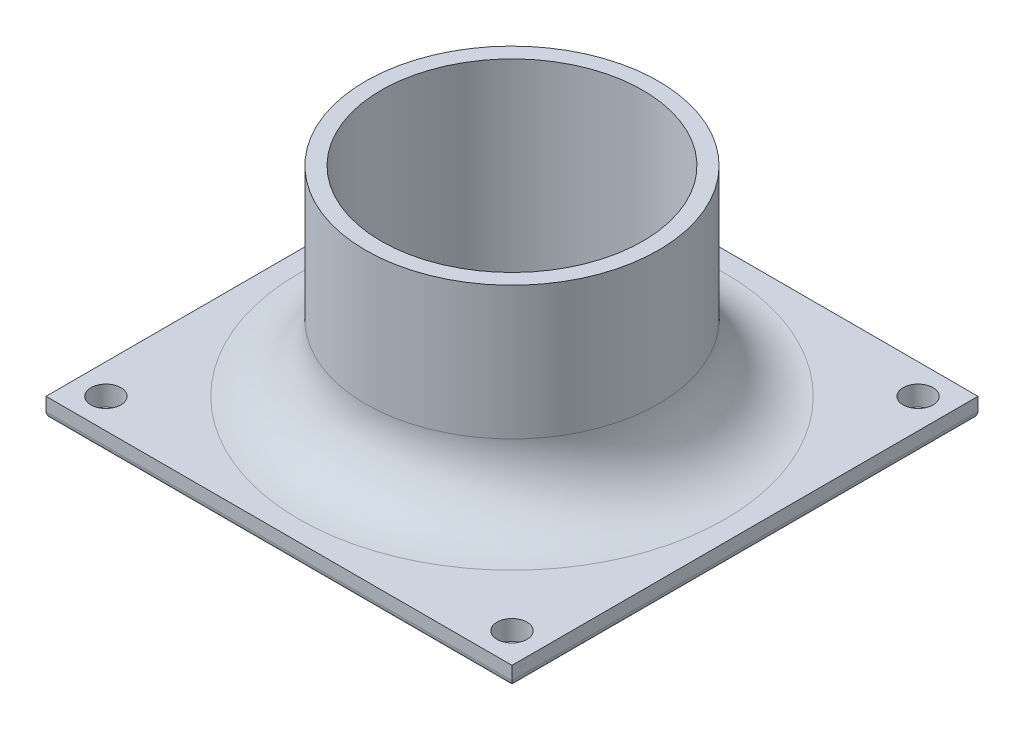
ISO-10303-21;
HEADER;
FILE_DESCRIPTION(('STEP AP214'),'2;1');
FILE_NAME('part.step','',(''),(''),'','','');
FILE_SCHEMA(('AUTOMOTIVE_DESIGN { 1 0 10303 214 1 1 1 1 }'));
ENDSEC;
DATA;
#1=APPLICATION_CONTEXT('core data for automotive mechanical design processes');
#2=APPLICATION_PROTOCOL_DEFINITION('international standard','automotive_design',2000,#1);
#3=PRODUCT_CONTEXT('',#1,'mechanical');
#4=PRODUCT('Part','Part','',(#3));
#5=PRODUCT_RELATED_PRODUCT_CATEGORY('part','',(#4));
#6=PRODUCT_DEFINITION_FORMATION('','',#4);
#7=PRODUCT_DEFINITION_CONTEXT('part definition',#1,'design');
#8=PRODUCT_DEFINITION('design','',#6,#7);
#9=PRODUCT_DEFINITION_SHAPE('','',#8);
#10=(LENGTH_UNIT() NAMED_UNIT(*) SI_UNIT(.MILLI.,.METRE.));
#11=(NAMED_UNIT(*) PLANE_ANGLE_UNIT() SI_UNIT($,.RADIAN.));
#12=(NAMED_UNIT(*) SI_UNIT($,.STERADIAN.) SOLID_ANGLE_UNIT());
#13=UNCERTAINTY_MEASURE_WITH_UNIT(LENGTH_MEASURE(1.E-05),#10,'distance_accuracy_value','');
#14=(GEOMETRIC_REPRESENTATION_CONTEXT(3) GLOBAL_UNCERTAINTY_ASSIGNED_CONTEXT((#13)) GLOBAL_UNIT_ASSIGNED_CONTEXT((#10,
#11,#12)) REPRESENTATION_CONTEXT('',''));
#15=CARTESIAN_POINT('',(0.,0.,0.));
#16=DIRECTION('',(0.,0.,1.));
#17=DIRECTION('',(1.,0.,0.));
#18=AXIS2_PLACEMENT_3D('',#15,#16,#17);
#19=CARTESIAN_POINT('',(0.,3.,0.));
#20=DIRECTION('',(0.,1.,0.));
#21=DIRECTION('',(0.,0.,1.));
#22=AXIS2_PLACEMENT_3D('',#19,#20,#21);
#23=PLANE('',#22);
#24=CARTESIAN_POINT('',(0.,3.,0.));
#25=DIRECTION('',(0.,1.,0.));
#26=DIRECTION('',(0.,0.,1.));
#27=AXIS2_PLACEMENT_3D('',#24,#25,#26);
#28=CIRCLE('',#27,18.);
#29=CARTESIAN_POINT('',(0.,3.,18.));
#30=VERTEX_POINT('',#29);
#31=EDGE_CURVE('E182',#30,#30,#28,.T.);
#32=ORIENTED_EDGE('',*,*,#31,.F.);
#33=EDGE_LOOP('',(#32));
#34=FACE_BOUND('',#33,.T.);
#35=CARTESIAN_POINT('',(0.,3.,0.));
#36=DIRECTION('',(0.,1.,0.));
#37=DIRECTION('',(0.,0.,1.));
#38=AXIS2_PLACEMENT_3D('',#35,#36,#37);
#39=CIRCLE('',#38,19.65);
#40=CARTESIAN_POINT('',(0.,3.,19.65));
#41=VERTEX_POINT('',#40);
#42=EDGE_CURVE('E107',#41,#41,#39,.F.);
#43=ORIENTED_EDGE('',*,*,#42,.F.);
#44=EDGE_LOOP('',(#43));
#45=FACE_BOUND('',#44,.T.);
#46=ADVANCED_FACE('F37',(#34,#45),#23,.T.);
#47=CARTESIAN_POINT('',(35.,3.,-35.));
#48=DIRECTION('',(-1.,0.,0.));
#49=DIRECTION('',(0.,0.,1.));
#50=AXIS2_PLACEMENT_3D('',#47,#48,#49);
#51=PLANE('',#50);
#52=DIRECTION('',(0.,-1.,0.));
#53=VECTOR('',#52,1.);
#54=CARTESIAN_POINT('',(35.,3.,35.));
#55=LINE('',#54,#53);
#56=CARTESIAN_POINT('',(35.,3.,35.));
#57=VERTEX_POINT('',#56);
#58=CARTESIAN_POINT('',(35.,1.,35.));
#59=VERTEX_POINT('',#58);
#60=EDGE_CURVE('E189',#57,#59,#55,.T.);
#61=ORIENTED_EDGE('',*,*,#60,.T.);
#62=DIRECTION('',(0.,0.,-1.));
#63=VECTOR('',#62,1.);
#64=CARTESIAN_POINT('',(35.,1.,-35.));
#65=LINE('',#64,#63);
#66=CARTESIAN_POINT('',(35.,1.,-35.));
#67=VERTEX_POINT('',#66);
#68=EDGE_CURVE('E11',#59,#67,#65,.T.);
#69=ORIENTED_EDGE('',*,*,#68,.T.);
#70=DIRECTION('',(0.,-1.,0.));
#71=VECTOR('',#70,1.);
#72=CARTESIAN_POINT('',(35.,3.,-35.));
#73=LINE('',#72,#71);
#74=CARTESIAN_POINT('',(35.,3.,-35.));
#75=VERTEX_POINT('',#74);
#76=EDGE_CURVE('E92',#75,#67,#73,.T.);
#77=ORIENTED_EDGE('',*,*,#76,.F.);
#78=DIRECTION('',(0.,0.,-1.));
#79=VECTOR('',#78,1.);
#80=CARTESIAN_POINT('',(35.,3.,-35.));
#81=LINE('',#80,#79);
#82=EDGE_CURVE('E97',#57,#75,#81,.T.);
#83=ORIENTED_EDGE('',*,*,#82,.F.);
#84=EDGE_LOOP('',(#61,#69,#77,#83));
#85=FACE_BOUND('',#84,.T.);
#86=ADVANCED_FACE('F106',(#85),#51,.F.);
#87=CARTESIAN_POINT('',(-35.,3.,-35.));
#88=DIRECTION('',(0.,0.,1.));
#89=DIRECTION('',(1.,0.,0.));
#90=AXIS2_PLACEMENT_3D('',#87,#88,#89);
#91=PLANE('',#90);
#92=ORIENTED_EDGE('',*,*,#76,.T.);
#93=DIRECTION('',(-1.,0.,0.));
#94=VECTOR('',#93,1.);
#95=CARTESIAN_POINT('',(-35.,1.,-35.));
#96=LINE('',#95,#94);
#97=CARTESIAN_POINT('',(-35.,1.,-35.));
#98=VERTEX_POINT('',#97);
#99=EDGE_CURVE('E46',#67,#98,#96,.T.);
#100=ORIENTED_EDGE('',*,*,#99,.T.);
#101=DIRECTION('',(0.,-1.,0.));
#102=VECTOR('',#101,1.);
#103=CARTESIAN_POINT('',(-35.,3.,-35.));
#104=LINE('',#103,#102);
#105=CARTESIAN_POINT('',(-35.,3.,-35.));
#106=VERTEX_POINT('',#105);
#107=EDGE_CURVE('E93',#106,#98,#104,.T.);
#108=ORIENTED_EDGE('',*,*,#107,.F.);
#109=DIRECTION('',(-1.,0.,0.));
#110=VECTOR('',#109,1.);
#111=CARTESIAN_POINT('',(-35.,3.,-35.));
#112=LINE('',#111,#110);
#113=EDGE_CURVE('E89',#75,#106,#112,.T.);
#114=ORIENTED_EDGE('',*,*,#113,.F.);
#115=EDGE_LOOP('',(#92,#100,#108,#114));
#116=FACE_BOUND('',#115,.T.);
#117=ADVANCED_FACE('F91',(#116),#91,.F.);
#118=CARTESIAN_POINT('',(-35.,3.,-35.));
#119=DIRECTION('',(1.,0.,0.));
#120=DIRECTION('',(0.,0.,-1.));
#121=AXIS2_PLACEMENT_3D('',#118,#119,#120);
#122=PLANE('',#121);
#123=ORIENTED_EDGE('',*,*,#107,.T.);
#124=DIRECTION('',(0.,0.,1.));
#125=VECTOR('',#124,1.);
#126=CARTESIAN_POINT('',(-35.,1.,-35.));
#127=LINE('',#126,#125);
#128=CARTESIAN_POINT('',(-35.,1.,35.));
#129=VERTEX_POINT('',#128);
#130=EDGE_CURVE('E133',#98,#129,#127,.T.);
#131=ORIENTED_EDGE('',*,*,#130,.T.);
#132=DIRECTION('',(0.,-1.,0.));
#133=VECTOR('',#132,1.);
#134=CARTESIAN_POINT('',(-35.,3.,35.));
#135=LINE('',#134,#133);
#136=CARTESIAN_POINT('',(-35.,3.,35.));
#137=VERTEX_POINT('',#136);
#138=EDGE_CURVE('E112',#137,#129,#135,.T.);
#139=ORIENTED_EDGE('',*,*,#138,.F.);
#140=DIRECTION('',(0.,0.,1.));
#141=VECTOR('',#140,1.);
#142=CARTESIAN_POINT('',(-35.,3.,-35.));
#143=LINE('',#142,#141);
#144=EDGE_CURVE('E96',#106,#137,#143,.T.);
#145=ORIENTED_EDGE('',*,*,#144,.F.);
#146=EDGE_LOOP('',(#123,#131,#139,#145));
#147=FACE_BOUND('',#146,.T.);
#148=ADVANCED_FACE('F230',(#147),#122,.F.);
#149=CARTESIAN_POINT('',(-35.,3.,35.));
#150=DIRECTION('',(0.,0.,-1.));
#151=DIRECTION('',(-1.,0.,0.));
#152=AXIS2_PLACEMENT_3D('',#149,#150,#151);
#153=PLANE('',#152);
#154=ORIENTED_EDGE('',*,*,#138,.T.);
#155=DIRECTION('',(1.,0.,0.));
#156=VECTOR('',#155,1.);
#157=CARTESIAN_POINT('',(-35.,1.,35.));
#158=LINE('',#157,#156);
#159=EDGE_CURVE('E121',#129,#59,#158,.T.);
#160=ORIENTED_EDGE('',*,*,#159,.T.);
#161=ORIENTED_EDGE('',*,*,#60,.F.);
#162=DIRECTION('',(1.,0.,0.));
#163=VECTOR('',#162,1.);
#164=CARTESIAN_POINT('',(-35.,3.,35.));
#165=LINE('',#164,#163);
#166=EDGE_CURVE('E102',#137,#57,#165,.T.);
#167=ORIENTED_EDGE('',*,*,#166,.F.);
#168=EDGE_LOOP('',(#154,#160,#161,#167));
#169=FACE_BOUND('',#168,.T.);
#170=ADVANCED_FACE('F194',(#169),#153,.F.);
#171=CARTESIAN_POINT('',(30.5,3.,-30.5));
#172=DIRECTION('',(0.,-1.,0.));
#173=DIRECTION('',(0.,0.,1.));
#174=AXIS2_PLACEMENT_3D('',#171,#172,#173);
#175=CIRCLE('',#174,2.25000000000001);
#176=CARTESIAN_POINT('',(30.5,3.,-28.25));
#177=VERTEX_POINT('',#176);
#178=EDGE_CURVE('E151',#177,#177,#175,.T.);
#179=ORIENTED_EDGE('',*,*,#178,.T.);
#180=EDGE_LOOP('',(#179));
#181=FACE_BOUND('',#180,.T.);
#182=CARTESIAN_POINT('',(30.5,3.,30.5));
#183=DIRECTION('',(0.,1.,0.));
#184=DIRECTION('',(0.,0.,-1.));
#185=AXIS2_PLACEMENT_3D('',#182,#183,#184);
#186=CIRCLE('',#185,2.25000000000001);
#187=CARTESIAN_POINT('',(30.5,3.,28.25));
#188=VERTEX_POINT('',#187);
#189=EDGE_CURVE('E159',#188,#188,#186,.T.);
#190=ORIENTED_EDGE('',*,*,#189,.F.);
#191=EDGE_LOOP('',(#190));
#192=FACE_BOUND('',#191,.T.);
#193=CARTESIAN_POINT('',(-30.5,3.,-30.5));
#194=DIRECTION('',(0.,1.,0.));
#195=DIRECTION('',(0.,0.,1.));
#196=AXIS2_PLACEMENT_3D('',#193,#194,#195);
#197=CIRCLE('',#196,2.25000000000001);
#198=CARTESIAN_POINT('',(-30.5,3.,-28.25));
#199=VERTEX_POINT('',#198);
#200=EDGE_CURVE('E165',#199,#199,#197,.T.);
#201=ORIENTED_EDGE('',*,*,#200,.F.);
#202=EDGE_LOOP('',(#201));
#203=FACE_BOUND('',#202,.T.);
#204=CARTESIAN_POINT('',(-30.5,3.,30.5));
#205=DIRECTION('',(0.,-1.,0.));
#206=DIRECTION('',(0.,0.,-1.));
#207=AXIS2_PLACEMENT_3D('',#204,#205,#206);
#208=CIRCLE('',#207,2.25000000000001);
#209=CARTESIAN_POINT('',(-30.5,3.,28.25));
#210=VERTEX_POINT('',#209);
#211=EDGE_CURVE('E171',#210,#210,#208,.T.);
#212=ORIENTED_EDGE('',*,*,#211,.T.);
#213=EDGE_LOOP('',(#212));
#214=FACE_BOUND('',#213,.T.);
#215=CARTESIAN_POINT('',(0.,3.,0.));
#216=DIRECTION('',(0.,1.,0.));
#217=DIRECTION('',(0.,0.,1.));
#218=AXIS2_PLACEMENT_3D('',#215,#216,#217);
#219=CIRCLE('',#218,32.);
#220=CARTESIAN_POINT('',(0.,3.,32.));
#221=VERTEX_POINT('',#220);
#222=EDGE_CURVE('E118',#221,#221,#219,.F.);
#223=ORIENTED_EDGE('',*,*,#222,.T.);
#224=EDGE_LOOP('',(#223));
#225=FACE_BOUND('',#224,.T.);
#226=ORIENTED_EDGE('',*,*,#82,.T.);
#227=ORIENTED_EDGE('',*,*,#113,.T.);
#228=ORIENTED_EDGE('',*,*,#144,.T.);
#229=ORIENTED_EDGE('',*,*,#166,.T.);
#230=EDGE_LOOP('',(#226,#227,#228,#229));
#231=FACE_BOUND('',#230,.T.);
#232=ADVANCED_FACE('F100',(#181,#192,#203,#214,#225,#231),#23,.T.);
#233=CARTESIAN_POINT('',(0.,0.,0.));
#234=DIRECTION('',(0.,1.,0.));
#235=DIRECTION('',(0.,0.,1.));
#236=AXIS2_PLACEMENT_3D('',#233,#234,#235);
#237=PLANE('',#236);
#238=DIRECTION('',(0.,0.,-1.));
#239=VECTOR('',#238,1.);
#240=CARTESIAN_POINT('',(34.,0.,0.));
#241=LINE('',#240,#239);
#242=CARTESIAN_POINT('',(34.,0.,-34.));
#243=VERTEX_POINT('',#242);
#244=CARTESIAN_POINT('',(34.,0.,34.));
#245=VERTEX_POINT('',#244);
#246=EDGE_CURVE('E124',#243,#245,#241,.F.);
#247=ORIENTED_EDGE('',*,*,#246,.T.);
#248=DIRECTION('',(1.,0.,0.));
#249=VECTOR('',#248,1.);
#250=CARTESIAN_POINT('',(0.,0.,34.));
#251=LINE('',#250,#249);
#252=CARTESIAN_POINT('',(-34.,0.,34.));
#253=VERTEX_POINT('',#252);
#254=EDGE_CURVE('E130',#245,#253,#251,.F.);
#255=ORIENTED_EDGE('',*,*,#254,.T.);
#256=DIRECTION('',(0.,0.,1.));
#257=VECTOR('',#256,1.);
#258=CARTESIAN_POINT('',(-34.,0.,0.));
#259=LINE('',#258,#257);
#260=CARTESIAN_POINT('',(-34.,0.,-34.));
#261=VERTEX_POINT('',#260);
#262=EDGE_CURVE('E128',#253,#261,#259,.F.);
#263=ORIENTED_EDGE('',*,*,#262,.T.);
#264=DIRECTION('',(-1.,0.,0.));
#265=VECTOR('',#264,1.);
#266=CARTESIAN_POINT('',(0.,0.,-34.));
#267=LINE('',#266,#265);
#268=EDGE_CURVE('E126',#261,#243,#267,.F.);
#269=ORIENTED_EDGE('',*,*,#268,.T.);
#270=EDGE_LOOP('',(#247,#255,#263,#269));
#271=FACE_BOUND('',#270,.T.);
#272=CARTESIAN_POINT('',(30.5,0.,-30.5));
#273=DIRECTION('',(0.,-1.,0.));
#274=DIRECTION('',(0.,0.,1.));
#275=AXIS2_PLACEMENT_3D('',#272,#273,#274);
#276=CIRCLE('',#275,2.25000000000001);
#277=CARTESIAN_POINT('',(30.5,0.,-28.25));
#278=VERTEX_POINT('',#277);
#279=EDGE_CURVE('E145',#278,#278,#276,.T.);
#280=ORIENTED_EDGE('',*,*,#279,.F.);
#281=EDGE_LOOP('',(#280));
#282=FACE_BOUND('',#281,.T.);
#283=CARTESIAN_POINT('',(30.5,0.,30.5));
#284=DIRECTION('',(0.,1.,0.));
#285=DIRECTION('',(0.,0.,-1.));
#286=AXIS2_PLACEMENT_3D('',#283,#284,#285);
#287=CIRCLE('',#286,2.25000000000001);
#288=CARTESIAN_POINT('',(30.5,0.,28.25));
#289=VERTEX_POINT('',#288);
#290=EDGE_CURVE('E156',#289,#289,#287,.T.);
#291=ORIENTED_EDGE('',*,*,#290,.T.);
#292=EDGE_LOOP('',(#291));
#293=FACE_BOUND('',#292,.T.);
#294=CARTESIAN_POINT('',(-30.5,0.,-30.5));
#295=DIRECTION('',(0.,1.,0.));
#296=DIRECTION('',(0.,0.,1.));
#297=AXIS2_PLACEMENT_3D('',#294,#295,#296);
#298=CIRCLE('',#297,2.25000000000001);
#299=CARTESIAN_POINT('',(-30.5,0.,-28.25));
#300=VERTEX_POINT('',#299);
#301=EDGE_CURVE('E162',#300,#300,#298,.T.);
#302=ORIENTED_EDGE('',*,*,#301,.T.);
#303=EDGE_LOOP('',(#302));
#304=FACE_BOUND('',#303,.T.);
#305=CARTESIAN_POINT('',(-30.5,0.,30.5));
#306=DIRECTION('',(0.,-1.,0.));
#307=DIRECTION('',(0.,0.,-1.));
#308=AXIS2_PLACEMENT_3D('',#305,#306,#307);
#309=CIRCLE('',#308,2.25000000000001);
#310=CARTESIAN_POINT('',(-30.5,0.,28.25));
#311=VERTEX_POINT('',#310);
#312=EDGE_CURVE('E168',#311,#311,#309,.T.);
#313=ORIENTED_EDGE('',*,*,#312,.F.);
#314=EDGE_LOOP('',(#313));
#315=FACE_BOUND('',#314,.T.);
#316=CARTESIAN_POINT('',(0.,0.,0.));
#317=DIRECTION('',(0.,1.,0.));
#318=DIRECTION('',(0.,0.,1.));
#319=AXIS2_PLACEMENT_3D('',#316,#317,#318);
#320=CIRCLE('',#319,18.);
#321=CARTESIAN_POINT('',(0.,0.,18.));
#322=VERTEX_POINT('',#321);
#323=EDGE_CURVE('E104',#322,#322,#320,.T.);
#324=ORIENTED_EDGE('',*,*,#323,.T.);
#325=EDGE_LOOP('',(#324));
#326=FACE_BOUND('',#325,.T.);
#327=ADVANCED_FACE('F222',(#271,#282,#293,#304,#315,#326),#237,.F.);
#328=CARTESIAN_POINT('',(0.,0.,0.));
#329=DIRECTION('',(0.,1.,0.));
#330=DIRECTION('',(0.,0.,1.));
#331=AXIS2_PLACEMENT_3D('',#328,#329,#330);
#332=CYLINDRICAL_SURFACE('',#331,18.);
#333=ORIENTED_EDGE('',*,*,#323,.F.);
#334=EDGE_LOOP('',(#333));
#335=FACE_BOUND('',#334,.T.);
#336=ORIENTED_EDGE('',*,*,#31,.T.);
#337=EDGE_LOOP('',(#336));
#338=FACE_BOUND('',#337,.T.);
#339=ADVANCED_FACE('F228',(#335,#338),#332,.F.);
#340=CARTESIAN_POINT('',(0.,33.,0.));
#341=DIRECTION('',(0.,1.,0.));
#342=DIRECTION('',(0.,0.,1.));
#343=AXIS2_PLACEMENT_3D('',#340,#341,#342);
#344=PLANE('',#343);
#345=CARTESIAN_POINT('',(0.,33.,0.));
#346=DIRECTION('',(0.,1.,0.));
#347=DIRECTION('',(0.,0.,1.));
#348=AXIS2_PLACEMENT_3D('',#345,#346,#347);
#349=CIRCLE('',#348,22.);
#350=CARTESIAN_POINT('',(0.,33.,22.));
#351=VERTEX_POINT('',#350);
#352=EDGE_CURVE('E179',#351,#351,#349,.T.);
#353=ORIENTED_EDGE('',*,*,#352,.T.);
#354=EDGE_LOOP('',(#353));
#355=FACE_BOUND('',#354,.T.);
#356=CARTESIAN_POINT('',(0.,33.,0.));
#357=DIRECTION('',(0.,1.,0.));
#358=DIRECTION('',(0.,0.,1.));
#359=AXIS2_PLACEMENT_3D('',#356,#357,#358);
#360=CIRCLE('',#359,19.65);
#361=CARTESIAN_POINT('',(0.,33.,19.65));
#362=VERTEX_POINT('',#361);
#363=EDGE_CURVE('E174',#362,#362,#360,.T.);
#364=ORIENTED_EDGE('',*,*,#363,.F.);
#365=EDGE_LOOP('',(#364));
#366=FACE_BOUND('',#365,.T.);
#367=ADVANCED_FACE('F253',(#355,#366),#344,.T.);
#368=CARTESIAN_POINT('',(0.,33.,0.));
#369=DIRECTION('',(0.,-1.,0.));
#370=DIRECTION('',(0.,0.,-1.));
#371=AXIS2_PLACEMENT_3D('',#368,#369,#370);
#372=CYLINDRICAL_SURFACE('',#371,22.);
#373=CARTESIAN_POINT('',(0.,13.,0.));
#374=DIRECTION('',(0.,1.,0.));
#375=DIRECTION('',(0.,0.,1.));
#376=AXIS2_PLACEMENT_3D('',#373,#374,#375);
#377=CIRCLE('',#376,22.);
#378=CARTESIAN_POINT('',(0.,13.,22.));
#379=VERTEX_POINT('',#378);
#380=EDGE_CURVE('E110',#379,#379,#377,.T.);
#381=ORIENTED_EDGE('',*,*,#380,.T.);
#382=EDGE_LOOP('',(#381));
#383=FACE_BOUND('',#382,.T.);
#384=ORIENTED_EDGE('',*,*,#352,.F.);
#385=EDGE_LOOP('',(#384));
#386=FACE_BOUND('',#385,.T.);
#387=ADVANCED_FACE('F250',(#383,#386),#372,.T.);
#388=CARTESIAN_POINT('',(0.,33.,0.));
#389=DIRECTION('',(0.,-1.,0.));
#390=DIRECTION('',(0.,0.,-1.));
#391=AXIS2_PLACEMENT_3D('',#388,#389,#390);
#392=CYLINDRICAL_SURFACE('',#391,19.65);
#393=ORIENTED_EDGE('',*,*,#363,.T.);
#394=EDGE_LOOP('',(#393));
#395=FACE_BOUND('',#394,.T.);
#396=ORIENTED_EDGE('',*,*,#42,.T.);
#397=EDGE_LOOP('',(#396));
#398=FACE_BOUND('',#397,.T.);
#399=ADVANCED_FACE('F246',(#395,#398),#392,.F.);
#400=CARTESIAN_POINT('',(0.,13.,0.));
#401=DIRECTION('',(0.,1.,0.));
#402=DIRECTION('',(0.,0.,1.));
#403=AXIS2_PLACEMENT_3D('',#400,#401,#402);
#404=TOROIDAL_SURFACE('',#403,32.,10.);
#405=ORIENTED_EDGE('',*,*,#222,.F.);
#406=EDGE_LOOP('',(#405));
#407=FACE_BOUND('',#406,.T.);
#408=ORIENTED_EDGE('',*,*,#380,.F.);
#409=EDGE_LOOP('',(#408));
#410=FACE_BOUND('',#409,.T.);
#411=ADVANCED_FACE('F242',(#407,#410),#404,.F.);
#412=CARTESIAN_POINT('',(-30.5,3.,30.5));
#413=DIRECTION('',(0.,-1.,0.));
#414=DIRECTION('',(0.,0.,-1.));
#415=AXIS2_PLACEMENT_3D('',#412,#413,#414);
#416=CYLINDRICAL_SURFACE('',#415,2.25000000000001);
#417=ORIENTED_EDGE('',*,*,#211,.F.);
#418=EDGE_LOOP('',(#417));
#419=FACE_BOUND('',#418,.T.);
#420=ORIENTED_EDGE('',*,*,#312,.T.);
#421=EDGE_LOOP('',(#420));
#422=FACE_BOUND('',#421,.T.);
#423=ADVANCED_FACE('F245',(#419,#422),#416,.F.);
#424=CARTESIAN_POINT('',(-30.5,3.,-30.5));
#425=DIRECTION('',(0.,-1.,0.));
#426=DIRECTION('',(0.,0.,-1.));
#427=AXIS2_PLACEMENT_3D('',#424,#425,#426);
#428=CYLINDRICAL_SURFACE('',#427,2.25000000000001);
#429=ORIENTED_EDGE('',*,*,#200,.T.);
#430=EDGE_LOOP('',(#429));
#431=FACE_BOUND('',#430,.T.);
#432=ORIENTED_EDGE('',*,*,#301,.F.);
#433=EDGE_LOOP('',(#432));
#434=FACE_BOUND('',#433,.T.);
#435=ADVANCED_FACE('F305',(#431,#434),#428,.F.);
#436=CARTESIAN_POINT('',(30.5,3.,30.5));
#437=DIRECTION('',(0.,-1.,0.));
#438=DIRECTION('',(0.,0.,-1.));
#439=AXIS2_PLACEMENT_3D('',#436,#437,#438);
#440=CYLINDRICAL_SURFACE('',#439,2.25000000000001);
#441=ORIENTED_EDGE('',*,*,#189,.T.);
#442=EDGE_LOOP('',(#441));
#443=FACE_BOUND('',#442,.T.);
#444=ORIENTED_EDGE('',*,*,#290,.F.);
#445=EDGE_LOOP('',(#444));
#446=FACE_BOUND('',#445,.T.);
#447=ADVANCED_FACE('F323',(#443,#446),#440,.F.);
#448=CARTESIAN_POINT('',(30.5,3.,-30.5));
#449=DIRECTION('',(0.,-1.,0.));
#450=DIRECTION('',(0.,0.,-1.));
#451=AXIS2_PLACEMENT_3D('',#448,#449,#450);
#452=CYLINDRICAL_SURFACE('',#451,2.25000000000001);
#453=ORIENTED_EDGE('',*,*,#178,.F.);
#454=EDGE_LOOP('',(#453));
#455=FACE_BOUND('',#454,.T.);
#456=ORIENTED_EDGE('',*,*,#279,.T.);
#457=EDGE_LOOP('',(#456));
#458=FACE_BOUND('',#457,.T.);
#459=ADVANCED_FACE('F333',(#455,#458),#452,.F.);
#460=CARTESIAN_POINT('',(-35.,1.,-34.));
#461=DIRECTION('',(-1.,0.,0.));
#462=DIRECTION('',(0.,0.,1.));
#463=AXIS2_PLACEMENT_3D('',#460,#461,#462);
#464=CYLINDRICAL_SURFACE('',#463,1.);
#465=CARTESIAN_POINT('',(34.,1.,-34.));
#466=DIRECTION('',(-0.707106781186548,0.,-0.707106781186547));
#467=DIRECTION('',(0.707106781186547,0.,-0.707106781186548));
#468=AXIS2_PLACEMENT_3D('',#465,#466,#467);
#469=ELLIPSE('',#468,1.41421356237309,1.);
#470=EDGE_CURVE('E139',#243,#67,#469,.F.);
#471=ORIENTED_EDGE('',*,*,#470,.F.);
#472=ORIENTED_EDGE('',*,*,#268,.F.);
#473=CARTESIAN_POINT('',(-34.,1.,-34.));
#474=DIRECTION('',(-0.707106781186547,0.,0.707106781186547));
#475=DIRECTION('',(-0.707106781186547,0.,-0.707106781186547));
#476=AXIS2_PLACEMENT_3D('',#473,#474,#475);
#477=ELLIPSE('',#476,1.41421356237309,1.);
#478=EDGE_CURVE('E41',#98,#261,#477,.T.);
#479=ORIENTED_EDGE('',*,*,#478,.F.);
#480=ORIENTED_EDGE('',*,*,#99,.F.);
#481=EDGE_LOOP('',(#471,#472,#479,#480));
#482=FACE_BOUND('',#481,.T.);
#483=ADVANCED_FACE('F39',(#482),#464,.T.);
#484=CARTESIAN_POINT('',(-34.,1.,-35.));
#485=DIRECTION('',(0.,0.,1.));
#486=DIRECTION('',(1.,0.,0.));
#487=AXIS2_PLACEMENT_3D('',#484,#485,#486);
#488=CYLINDRICAL_SURFACE('',#487,1.);
#489=ORIENTED_EDGE('',*,*,#478,.T.);
#490=ORIENTED_EDGE('',*,*,#262,.F.);
#491=CARTESIAN_POINT('',(-34.,1.,34.));
#492=DIRECTION('',(0.707106781186547,0.,0.707106781186547));
#493=DIRECTION('',(-0.707106781186547,0.,0.707106781186547));
#494=AXIS2_PLACEMENT_3D('',#491,#492,#493);
#495=ELLIPSE('',#494,1.41421356237309,1.);
#496=EDGE_CURVE('E138',#129,#253,#495,.T.);
#497=ORIENTED_EDGE('',*,*,#496,.F.);
#498=ORIENTED_EDGE('',*,*,#130,.F.);
#499=EDGE_LOOP('',(#489,#490,#497,#498));
#500=FACE_BOUND('',#499,.T.);
#501=ADVANCED_FACE('F197',(#500),#488,.T.);
#502=CARTESIAN_POINT('',(34.,1.,-35.));
#503=DIRECTION('',(0.,0.,-1.));
#504=DIRECTION('',(-1.,0.,0.));
#505=AXIS2_PLACEMENT_3D('',#502,#503,#504);
#506=CYLINDRICAL_SURFACE('',#505,1.);
#507=ORIENTED_EDGE('',*,*,#470,.T.);
#508=ORIENTED_EDGE('',*,*,#68,.F.);
#509=CARTESIAN_POINT('',(34.,1.,34.));
#510=DIRECTION('',(0.707106781186547,0.,-0.707106781186548));
#511=DIRECTION('',(-0.707106781186548,0.,-0.707106781186547));
#512=AXIS2_PLACEMENT_3D('',#509,#510,#511);
#513=ELLIPSE('',#512,1.4142135623731,1.);
#514=EDGE_CURVE('E136',#245,#59,#513,.F.);
#515=ORIENTED_EDGE('',*,*,#514,.F.);
#516=ORIENTED_EDGE('',*,*,#246,.F.);
#517=EDGE_LOOP('',(#507,#508,#515,#516));
#518=FACE_BOUND('',#517,.T.);
#519=ADVANCED_FACE('F202',(#518),#506,.T.);
#520=CARTESIAN_POINT('',(-35.,1.,34.));
#521=DIRECTION('',(1.,0.,0.));
#522=DIRECTION('',(0.,0.,-1.));
#523=AXIS2_PLACEMENT_3D('',#520,#521,#522);
#524=CYLINDRICAL_SURFACE('',#523,1.);
#525=ORIENTED_EDGE('',*,*,#496,.T.);
#526=ORIENTED_EDGE('',*,*,#254,.F.);
#527=ORIENTED_EDGE('',*,*,#514,.T.);
#528=ORIENTED_EDGE('',*,*,#159,.F.);
#529=EDGE_LOOP('',(#525,#526,#527,#528));
#530=FACE_BOUND('',#529,.T.);
#531=ADVANCED_FACE('F200',(#530),#524,.T.);
#532=CLOSED_SHELL('',(#46,#86,#117,#148,#170,#232,#327,#339,#367,#387,#399,#411,#423,#435,#447,
#459,#483,#501,#519,#531));
#533=MANIFOLD_SOLID_BREP('B2',#532);
#534=ADVANCED_BREP_SHAPE_REPRESENTATION('',(#18,#533),#14);
#535=SHAPE_DEFINITION_REPRESENTATION(#9,#534);
ENDSEC;
END-ISO-10303-21;
